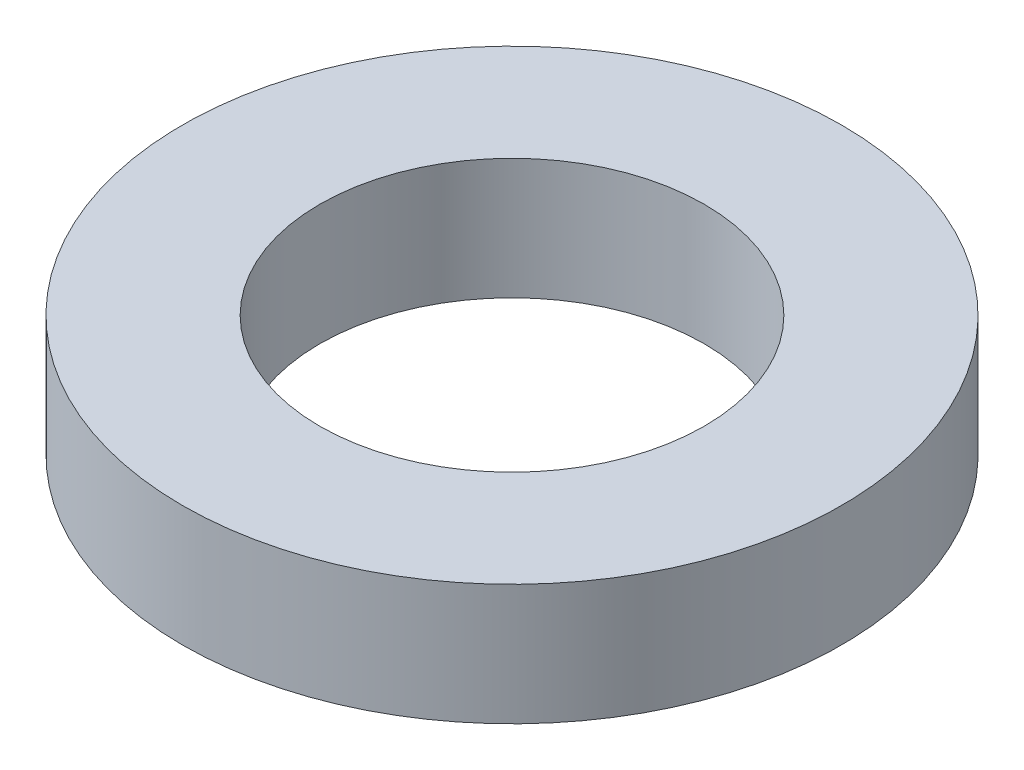
ISO-10303-21;
HEADER;
FILE_DESCRIPTION(('STEP AP214'),'2;1');
FILE_NAME('part.step','',(''),(''),'','','');
FILE_SCHEMA(('AUTOMOTIVE_DESIGN { 1 0 10303 214 1 1 1 1 }'));
ENDSEC;
DATA;
#1=APPLICATION_CONTEXT('core data for automotive mechanical design processes');
#2=APPLICATION_PROTOCOL_DEFINITION('international standard','automotive_design',2000,#1);
#3=PRODUCT_CONTEXT('',#1,'mechanical');
#4=PRODUCT('Part','Part','',(#3));
#5=PRODUCT_RELATED_PRODUCT_CATEGORY('part','',(#4));
#6=PRODUCT_DEFINITION_FORMATION('','',#4);
#7=PRODUCT_DEFINITION_CONTEXT('part definition',#1,'design');
#8=PRODUCT_DEFINITION('design','',#6,#7);
#9=PRODUCT_DEFINITION_SHAPE('','',#8);
#10=(LENGTH_UNIT() NAMED_UNIT(*) SI_UNIT(.MILLI.,.METRE.));
#11=(NAMED_UNIT(*) PLANE_ANGLE_UNIT() SI_UNIT($,.RADIAN.));
#12=(NAMED_UNIT(*) SI_UNIT($,.STERADIAN.) SOLID_ANGLE_UNIT());
#13=UNCERTAINTY_MEASURE_WITH_UNIT(LENGTH_MEASURE(1.E-05),#10,'distance_accuracy_value','');
#14=(GEOMETRIC_REPRESENTATION_CONTEXT(3) GLOBAL_UNCERTAINTY_ASSIGNED_CONTEXT((#13)) GLOBAL_UNIT_ASSIGNED_CONTEXT((#10,
#11,#12)) REPRESENTATION_CONTEXT('',''));
#15=CARTESIAN_POINT('',(0.,0.,0.));
#16=DIRECTION('',(0.,0.,1.));
#17=DIRECTION('',(1.,0.,0.));
#18=AXIS2_PLACEMENT_3D('',#15,#16,#17);
#19=CARTESIAN_POINT('',(0.,22.,0.));
#20=DIRECTION('',(0.,-1.,0.));
#21=DIRECTION('',(0.,0.,-1.));
#22=AXIS2_PLACEMENT_3D('',#19,#20,#21);
#23=CYLINDRICAL_SURFACE('',#22,60.);
#24=CARTESIAN_POINT('',(0.,22.,0.));
#25=DIRECTION('',(0.,1.,0.));
#26=DIRECTION('',(0.,0.,1.));
#27=AXIS2_PLACEMENT_3D('',#24,#25,#26);
#28=CIRCLE('',#27,60.);
#29=CARTESIAN_POINT('',(0.,22.,60.));
#30=VERTEX_POINT('',#29);
#31=EDGE_CURVE('E10',#30,#30,#28,.T.);
#32=ORIENTED_EDGE('',*,*,#31,.F.);
#33=EDGE_LOOP('',(#32));
#34=FACE_BOUND('',#33,.T.);
#35=CARTESIAN_POINT('',(0.,0.,0.));
#36=DIRECTION('',(0.,1.,0.));
#37=DIRECTION('',(0.,0.,1.));
#38=AXIS2_PLACEMENT_3D('',#35,#36,#37);
#39=CIRCLE('',#38,60.);
#40=CARTESIAN_POINT('',(0.,0.,60.));
#41=VERTEX_POINT('',#40);
#42=EDGE_CURVE('E37',#41,#41,#39,.T.);
#43=ORIENTED_EDGE('',*,*,#42,.T.);
#44=EDGE_LOOP('',(#43));
#45=FACE_BOUND('',#44,.T.);
#46=ADVANCED_FACE('F40',(#34,#45),#23,.T.);
#47=CARTESIAN_POINT('',(0.,22.,0.));
#48=DIRECTION('',(0.,1.,0.));
#49=DIRECTION('',(0.,0.,1.));
#50=AXIS2_PLACEMENT_3D('',#47,#48,#49);
#51=PLANE('',#50);
#52=CARTESIAN_POINT('',(0.,22.,0.));
#53=DIRECTION('',(0.,1.,0.));
#54=DIRECTION('',(0.,0.,1.));
#55=AXIS2_PLACEMENT_3D('',#52,#53,#54);
#56=CIRCLE('',#55,35.);
#57=CARTESIAN_POINT('',(0.,22.,35.));
#58=VERTEX_POINT('',#57);
#59=EDGE_CURVE('E50',#58,#58,#56,.T.);
#60=ORIENTED_EDGE('',*,*,#59,.F.);
#61=EDGE_LOOP('',(#60));
#62=FACE_BOUND('',#61,.T.);
#63=ORIENTED_EDGE('',*,*,#31,.T.);
#64=EDGE_LOOP('',(#63));
#65=FACE_BOUND('',#64,.T.);
#66=ADVANCED_FACE('F59',(#62,#65),#51,.T.);
#67=CARTESIAN_POINT('',(0.,0.,0.));
#68=DIRECTION('',(0.,1.,0.));
#69=DIRECTION('',(0.,0.,1.));
#70=AXIS2_PLACEMENT_3D('',#67,#68,#69);
#71=PLANE('',#70);
#72=CARTESIAN_POINT('',(0.,0.,0.));
#73=DIRECTION('',(0.,1.,0.));
#74=DIRECTION('',(0.,0.,1.));
#75=AXIS2_PLACEMENT_3D('',#72,#73,#74);
#76=CIRCLE('',#75,35.);
#77=CARTESIAN_POINT('',(0.,0.,35.));
#78=VERTEX_POINT('',#77);
#79=EDGE_CURVE('E47',#78,#78,#76,.T.);
#80=ORIENTED_EDGE('',*,*,#79,.T.);
#81=EDGE_LOOP('',(#80));
#82=FACE_BOUND('',#81,.T.);
#83=ORIENTED_EDGE('',*,*,#42,.F.);
#84=EDGE_LOOP('',(#83));
#85=FACE_BOUND('',#84,.T.);
#86=ADVANCED_FACE('F58',(#82,#85),#71,.F.);
#87=CARTESIAN_POINT('',(0.,22.,0.));
#88=DIRECTION('',(0.,-1.,0.));
#89=DIRECTION('',(0.,0.,-1.));
#90=AXIS2_PLACEMENT_3D('',#87,#88,#89);
#91=CYLINDRICAL_SURFACE('',#90,35.);
#92=ORIENTED_EDGE('',*,*,#59,.T.);
#93=EDGE_LOOP('',(#92));
#94=FACE_BOUND('',#93,.T.);
#95=ORIENTED_EDGE('',*,*,#79,.F.);
#96=EDGE_LOOP('',(#95));
#97=FACE_BOUND('',#96,.T.);
#98=ADVANCED_FACE('F54',(#94,#97),#91,.F.);
#99=CLOSED_SHELL('',(#46,#66,#86,#98));
#100=MANIFOLD_SOLID_BREP('B2',#99);
#101=ADVANCED_BREP_SHAPE_REPRESENTATION('',(#18,#100),#14);
#102=SHAPE_DEFINITION_REPRESENTATION(#9,#101);
ENDSEC;
END-ISO-10303-21;
